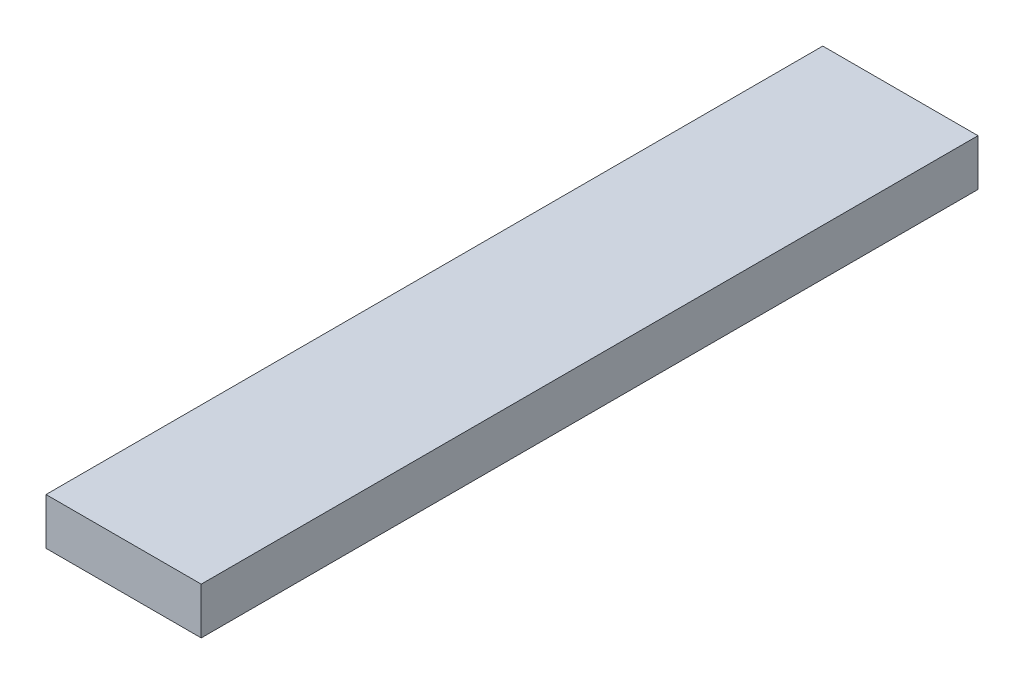
ISO-10303-21;
HEADER;
FILE_DESCRIPTION(('STEP AP214'),'2;1');
FILE_NAME('part.step','',(''),(''),'','','');
FILE_SCHEMA(('AUTOMOTIVE_DESIGN { 1 0 10303 214 1 1 1 1 }'));
ENDSEC;
DATA;
#1=APPLICATION_CONTEXT('core data for automotive mechanical design processes');
#2=APPLICATION_PROTOCOL_DEFINITION('international standard','automotive_design',2000,#1);
#3=PRODUCT_CONTEXT('',#1,'mechanical');
#4=PRODUCT('Part','Part','',(#3));
#5=PRODUCT_RELATED_PRODUCT_CATEGORY('part','',(#4));
#6=PRODUCT_DEFINITION_FORMATION('','',#4);
#7=PRODUCT_DEFINITION_CONTEXT('part definition',#1,'design');
#8=PRODUCT_DEFINITION('design','',#6,#7);
#9=PRODUCT_DEFINITION_SHAPE('','',#8);
#10=(LENGTH_UNIT() NAMED_UNIT(*) SI_UNIT(.MILLI.,.METRE.));
#11=(NAMED_UNIT(*) PLANE_ANGLE_UNIT() SI_UNIT($,.RADIAN.));
#12=(NAMED_UNIT(*) SI_UNIT($,.STERADIAN.) SOLID_ANGLE_UNIT());
#13=UNCERTAINTY_MEASURE_WITH_UNIT(LENGTH_MEASURE(1.E-05),#10,'distance_accuracy_value','');
#14=(GEOMETRIC_REPRESENTATION_CONTEXT(3) GLOBAL_UNCERTAINTY_ASSIGNED_CONTEXT((#13)) GLOBAL_UNIT_ASSIGNED_CONTEXT((#10,
#11,#12)) REPRESENTATION_CONTEXT('',''));
#15=CARTESIAN_POINT('',(0.,0.,0.));
#16=DIRECTION('',(0.,0.,1.));
#17=DIRECTION('',(1.,0.,0.));
#18=AXIS2_PLACEMENT_3D('',#15,#16,#17);
#19=CARTESIAN_POINT('',(-20.3544303797468,2.99,-37.8481012658228));
#20=DIRECTION('',(0.,0.,-1.));
#21=DIRECTION('',(-1.,0.,0.));
#22=AXIS2_PLACEMENT_3D('',#19,#20,#21);
#23=PLANE('',#22);
#24=DIRECTION('',(0.,1.,0.));
#25=VECTOR('',#24,1.);
#26=CARTESIAN_POINT('',(-10.3628691983122,2.99,-37.8481012658228));
#27=LINE('',#26,#25);
#28=CARTESIAN_POINT('',(-10.3628691983122,47.,-37.8481012658228));
#29=VERTEX_POINT('',#28);
#30=CARTESIAN_POINT('',(-10.3628691983122,50.,-37.8481012658228));
#31=VERTEX_POINT('',#30);
#32=EDGE_CURVE('E11',#29,#31,#27,.T.);
#33=ORIENTED_EDGE('',*,*,#32,.F.);
#34=DIRECTION('',(-1.,0.,0.));
#35=VECTOR('',#34,1.);
#36=CARTESIAN_POINT('',(0.,47.,-37.8481012658228));
#37=LINE('',#36,#35);
#38=CARTESIAN_POINT('',(-20.3544303797468,47.,-37.8481012658228));
#39=VERTEX_POINT('',#38);
#40=EDGE_CURVE('E39',#29,#39,#37,.T.);
#41=ORIENTED_EDGE('',*,*,#40,.T.);
#42=DIRECTION('',(0.,1.,0.));
#43=VECTOR('',#42,1.);
#44=CARTESIAN_POINT('',(-20.3544303797468,2.99,-37.8481012658228));
#45=LINE('',#44,#43);
#46=CARTESIAN_POINT('',(-20.3544303797468,50.,-37.8481012658228));
#47=VERTEX_POINT('',#46);
#48=EDGE_CURVE('E44',#39,#47,#45,.T.);
#49=ORIENTED_EDGE('',*,*,#48,.T.);
#50=DIRECTION('',(-1.,0.,0.));
#51=VECTOR('',#50,1.);
#52=CARTESIAN_POINT('',(0.,50.,-37.8481012658228));
#53=LINE('',#52,#51);
#54=EDGE_CURVE('E87',#31,#47,#53,.T.);
#55=ORIENTED_EDGE('',*,*,#54,.F.);
#56=EDGE_LOOP('',(#33,#41,#49,#55));
#57=FACE_BOUND('',#56,.T.);
#58=ADVANCED_FACE('F35',(#57),#23,.T.);
#59=CARTESIAN_POINT('',(-10.3628691983122,2.99,-37.8481012658228));
#60=DIRECTION('',(1.,0.,0.));
#61=DIRECTION('',(0.,0.,-1.));
#62=AXIS2_PLACEMENT_3D('',#59,#60,#61);
#63=PLANE('',#62);
#64=DIRECTION('',(0.,1.,0.));
#65=VECTOR('',#64,1.);
#66=CARTESIAN_POINT('',(-10.3628691983122,2.99,12.1518987341772));
#67=LINE('',#66,#65);
#68=CARTESIAN_POINT('',(-10.3628691983122,47.,12.1518987341772));
#69=VERTEX_POINT('',#68);
#70=CARTESIAN_POINT('',(-10.3628691983122,50.,12.1518987341772));
#71=VERTEX_POINT('',#70);
#72=EDGE_CURVE('E86',#69,#71,#67,.T.);
#73=ORIENTED_EDGE('',*,*,#72,.F.);
#74=DIRECTION('',(0.,0.,-1.));
#75=VECTOR('',#74,1.);
#76=CARTESIAN_POINT('',(-10.3628691983122,47.,0.));
#77=LINE('',#76,#75);
#78=EDGE_CURVE('E94',#69,#29,#77,.T.);
#79=ORIENTED_EDGE('',*,*,#78,.T.);
#80=ORIENTED_EDGE('',*,*,#32,.T.);
#81=DIRECTION('',(0.,0.,-1.));
#82=VECTOR('',#81,1.);
#83=CARTESIAN_POINT('',(-10.3628691983122,50.,0.));
#84=LINE('',#83,#82);
#85=EDGE_CURVE('E103',#71,#31,#84,.T.);
#86=ORIENTED_EDGE('',*,*,#85,.F.);
#87=EDGE_LOOP('',(#73,#79,#80,#86));
#88=FACE_BOUND('',#87,.T.);
#89=ADVANCED_FACE('F109',(#88),#63,.T.);
#90=CARTESIAN_POINT('',(-20.3544303797468,2.99,-37.8481012658228));
#91=DIRECTION('',(-1.,0.,0.));
#92=DIRECTION('',(0.,0.,1.));
#93=AXIS2_PLACEMENT_3D('',#90,#91,#92);
#94=PLANE('',#93);
#95=ORIENTED_EDGE('',*,*,#48,.F.);
#96=DIRECTION('',(0.,0.,1.));
#97=VECTOR('',#96,1.);
#98=CARTESIAN_POINT('',(-20.3544303797468,47.,0.));
#99=LINE('',#98,#97);
#100=CARTESIAN_POINT('',(-20.3544303797468,47.,12.1518987341772));
#101=VERTEX_POINT('',#100);
#102=EDGE_CURVE('E93',#39,#101,#99,.T.);
#103=ORIENTED_EDGE('',*,*,#102,.T.);
#104=DIRECTION('',(0.,1.,0.));
#105=VECTOR('',#104,1.);
#106=CARTESIAN_POINT('',(-20.3544303797468,2.99,12.1518987341772));
#107=LINE('',#106,#105);
#108=CARTESIAN_POINT('',(-20.3544303797468,50.,12.1518987341772));
#109=VERTEX_POINT('',#108);
#110=EDGE_CURVE('E76',#101,#109,#107,.T.);
#111=ORIENTED_EDGE('',*,*,#110,.T.);
#112=DIRECTION('',(0.,0.,1.));
#113=VECTOR('',#112,1.);
#114=CARTESIAN_POINT('',(-20.3544303797468,50.,0.));
#115=LINE('',#114,#113);
#116=EDGE_CURVE('E97',#47,#109,#115,.T.);
#117=ORIENTED_EDGE('',*,*,#116,.F.);
#118=EDGE_LOOP('',(#95,#103,#111,#117));
#119=FACE_BOUND('',#118,.T.);
#120=ADVANCED_FACE('F96',(#119),#94,.T.);
#121=CARTESIAN_POINT('',(-20.3544303797468,2.99,12.1518987341772));
#122=DIRECTION('',(0.,0.,1.));
#123=DIRECTION('',(1.,0.,0.));
#124=AXIS2_PLACEMENT_3D('',#121,#122,#123);
#125=PLANE('',#124);
#126=ORIENTED_EDGE('',*,*,#110,.F.);
#127=DIRECTION('',(1.,0.,0.));
#128=VECTOR('',#127,1.);
#129=CARTESIAN_POINT('',(0.,47.,12.1518987341772));
#130=LINE('',#129,#128);
#131=EDGE_CURVE('E79',#101,#69,#130,.T.);
#132=ORIENTED_EDGE('',*,*,#131,.T.);
#133=ORIENTED_EDGE('',*,*,#72,.T.);
#134=DIRECTION('',(1.,0.,0.));
#135=VECTOR('',#134,1.);
#136=CARTESIAN_POINT('',(0.,50.,12.1518987341772));
#137=LINE('',#136,#135);
#138=EDGE_CURVE('E81',#109,#71,#137,.T.);
#139=ORIENTED_EDGE('',*,*,#138,.F.);
#140=EDGE_LOOP('',(#126,#132,#133,#139));
#141=FACE_BOUND('',#140,.T.);
#142=ADVANCED_FACE('F78',(#141),#125,.T.);
#143=CARTESIAN_POINT('',(0.,50.,0.));
#144=DIRECTION('',(0.,1.,0.));
#145=DIRECTION('',(0.,0.,1.));
#146=AXIS2_PLACEMENT_3D('',#143,#144,#145);
#147=PLANE('',#146);
#148=ORIENTED_EDGE('',*,*,#54,.T.);
#149=ORIENTED_EDGE('',*,*,#116,.T.);
#150=ORIENTED_EDGE('',*,*,#138,.T.);
#151=ORIENTED_EDGE('',*,*,#85,.T.);
#152=EDGE_LOOP('',(#148,#149,#150,#151));
#153=FACE_BOUND('',#152,.T.);
#154=ADVANCED_FACE('F105',(#153),#147,.T.);
#155=CARTESIAN_POINT('',(0.,47.,0.));
#156=DIRECTION('',(0.,1.,0.));
#157=DIRECTION('',(0.,0.,1.));
#158=AXIS2_PLACEMENT_3D('',#155,#156,#157);
#159=PLANE('',#158);
#160=ORIENTED_EDGE('',*,*,#102,.F.);
#161=ORIENTED_EDGE('',*,*,#40,.F.);
#162=ORIENTED_EDGE('',*,*,#78,.F.);
#163=ORIENTED_EDGE('',*,*,#131,.F.);
#164=EDGE_LOOP('',(#160,#161,#162,#163));
#165=FACE_BOUND('',#164,.T.);
#166=ADVANCED_FACE('F37',(#165),#159,.F.);
#167=CLOSED_SHELL('',(#58,#89,#120,#142,#154,#166));
#168=MANIFOLD_SOLID_BREP('B2',#167);
#169=ADVANCED_BREP_SHAPE_REPRESENTATION('',(#18,#168),#14);
#170=SHAPE_DEFINITION_REPRESENTATION(#9,#169);
ENDSEC;
END-ISO-10303-21;
